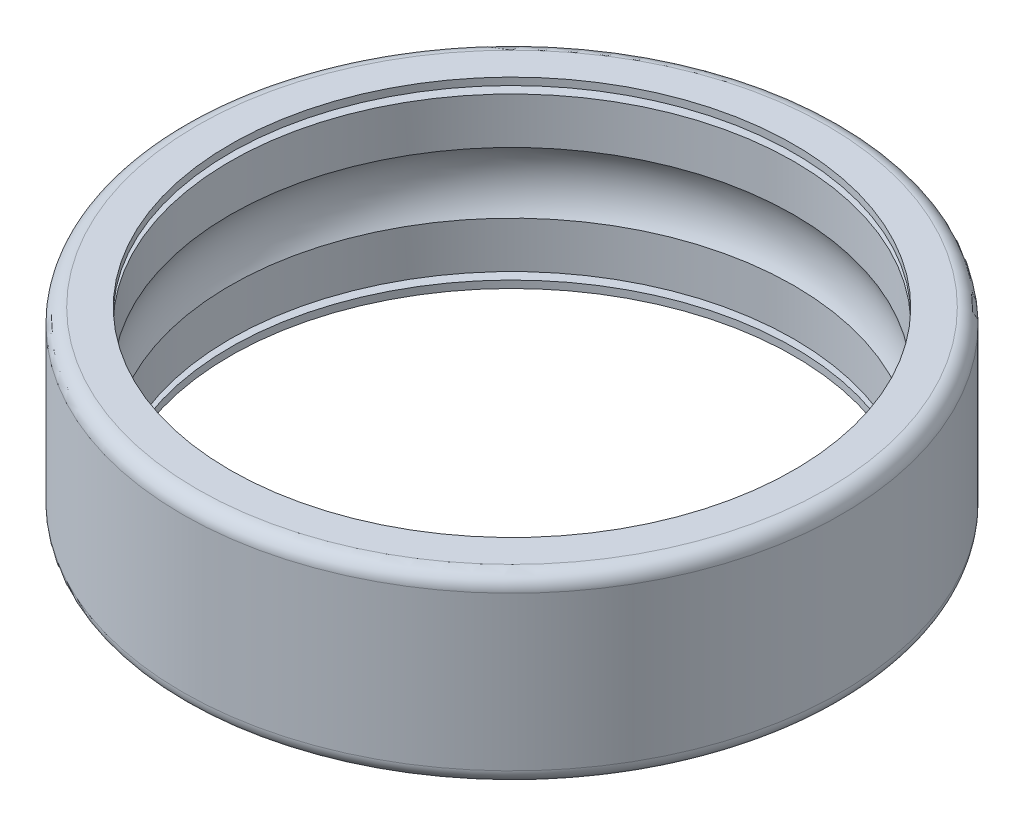
ISO-10303-21;
HEADER;
FILE_DESCRIPTION(('STEP AP214'),'2;1');
FILE_NAME('part.step','',(''),(''),'','','');
FILE_SCHEMA(('AUTOMOTIVE_DESIGN { 1 0 10303 214 1 1 1 1 }'));
ENDSEC;
DATA;
#1=APPLICATION_CONTEXT('core data for automotive mechanical design processes');
#2=APPLICATION_PROTOCOL_DEFINITION('international standard','automotive_design',2000,#1);
#3=PRODUCT_CONTEXT('',#1,'mechanical');
#4=PRODUCT('Part','Part','',(#3));
#5=PRODUCT_RELATED_PRODUCT_CATEGORY('part','',(#4));
#6=PRODUCT_DEFINITION_FORMATION('','',#4);
#7=PRODUCT_DEFINITION_CONTEXT('part definition',#1,'design');
#8=PRODUCT_DEFINITION('design','',#6,#7);
#9=PRODUCT_DEFINITION_SHAPE('','',#8);
#10=(LENGTH_UNIT() NAMED_UNIT(*) SI_UNIT(.MILLI.,.METRE.));
#11=(NAMED_UNIT(*) PLANE_ANGLE_UNIT() SI_UNIT($,.RADIAN.));
#12=(NAMED_UNIT(*) SI_UNIT($,.STERADIAN.) SOLID_ANGLE_UNIT());
#13=UNCERTAINTY_MEASURE_WITH_UNIT(LENGTH_MEASURE(1.E-05),#10,'distance_accuracy_value','');
#14=(GEOMETRIC_REPRESENTATION_CONTEXT(3) GLOBAL_UNCERTAINTY_ASSIGNED_CONTEXT((#13)) GLOBAL_UNIT_ASSIGNED_CONTEXT((#10,
#11,#12)) REPRESENTATION_CONTEXT('',''));
#15=CARTESIAN_POINT('',(0.,0.,0.));
#16=DIRECTION('',(0.,0.,1.));
#17=DIRECTION('',(1.,0.,0.));
#18=AXIS2_PLACEMENT_3D('',#15,#16,#17);
#19=CARTESIAN_POINT('',(0.,-1.375,0.));
#20=DIRECTION('',(0.,1.,0.));
#21=DIRECTION('',(0.,0.,-1.));
#22=AXIS2_PLACEMENT_3D('',#19,#20,#21);
#23=CYLINDRICAL_SURFACE('',#22,3.85);
#24=CARTESIAN_POINT('',(0.,-1.05,0.));
#25=DIRECTION('',(0.,1.,0.));
#26=DIRECTION('',(0.,0.,-1.));
#27=AXIS2_PLACEMENT_3D('',#24,#25,#26);
#28=CIRCLE('',#27,3.85);
#29=CARTESIAN_POINT('',(0.,-1.05,3.85));
#30=VERTEX_POINT('',#29);
#31=EDGE_CURVE('E11',#30,#30,#28,.T.);
#32=ORIENTED_EDGE('',*,*,#31,.F.);
#33=EDGE_LOOP('',(#32));
#34=FACE_BOUND('',#33,.T.);
#35=CARTESIAN_POINT('',(0.,-0.4181040540344,0.));
#36=DIRECTION('',(0.,1.,0.));
#37=DIRECTION('',(0.,0.,-1.));
#38=AXIS2_PLACEMENT_3D('',#35,#36,#37);
#39=CIRCLE('',#38,3.85);
#40=CARTESIAN_POINT('',(0.,-0.4181040540344,-3.85));
#41=VERTEX_POINT('',#40);
#42=EDGE_CURVE('E113',#41,#41,#39,.T.);
#43=ORIENTED_EDGE('',*,*,#42,.T.);
#44=EDGE_LOOP('',(#43));
#45=FACE_BOUND('',#44,.T.);
#46=ADVANCED_FACE('F16',(#34,#45),#23,.F.);
#47=CARTESIAN_POINT('',(0.,-1.05,0.));
#48=DIRECTION('',(0.,1.,0.));
#49=DIRECTION('',(1.,0.,0.));
#50=AXIS2_PLACEMENT_3D('',#47,#48,#49);
#51=PLANE('',#50);
#52=ORIENTED_EDGE('',*,*,#31,.T.);
#53=EDGE_LOOP('',(#52));
#54=FACE_BOUND('',#53,.T.);
#55=CARTESIAN_POINT('',(0.,-1.05,0.));
#56=DIRECTION('',(0.,-1.,0.));
#57=DIRECTION('',(0.,0.,-1.));
#58=AXIS2_PLACEMENT_3D('',#55,#56,#57);
#59=CIRCLE('',#58,4.25);
#60=CARTESIAN_POINT('',(0.,-1.05,4.25));
#61=VERTEX_POINT('',#60);
#62=EDGE_CURVE('E27',#61,#61,#59,.T.);
#63=ORIENTED_EDGE('',*,*,#62,.T.);
#64=EDGE_LOOP('',(#63));
#65=FACE_BOUND('',#64,.T.);
#66=ADVANCED_FACE('F18',(#54,#65),#51,.F.);
#67=CARTESIAN_POINT('',(0.,-1.375,0.));
#68=DIRECTION('',(0.,1.,0.));
#69=DIRECTION('',(0.,0.,-1.));
#70=AXIS2_PLACEMENT_3D('',#67,#68,#69);
#71=CYLINDRICAL_SURFACE('',#70,4.25);
#72=CARTESIAN_POINT('',(0.,-1.15,0.));
#73=DIRECTION('',(0.,1.,0.));
#74=DIRECTION('',(0.,0.,-1.));
#75=AXIS2_PLACEMENT_3D('',#72,#73,#74);
#76=CIRCLE('',#75,4.25);
#77=CARTESIAN_POINT('',(0.,-1.15,4.25));
#78=VERTEX_POINT('',#77);
#79=EDGE_CURVE('E118',#78,#78,#76,.T.);
#80=ORIENTED_EDGE('',*,*,#79,.F.);
#81=EDGE_LOOP('',(#80));
#82=FACE_BOUND('',#81,.T.);
#83=ORIENTED_EDGE('',*,*,#62,.F.);
#84=EDGE_LOOP('',(#83));
#85=FACE_BOUND('',#84,.T.);
#86=ADVANCED_FACE('F150',(#82,#85),#71,.F.);
#87=CARTESIAN_POINT('',(0.,-1.15,0.));
#88=DIRECTION('',(0.,1.,0.));
#89=DIRECTION('',(1.,0.,0.));
#90=AXIS2_PLACEMENT_3D('',#87,#88,#89);
#91=PLANE('',#90);
#92=CARTESIAN_POINT('',(0.,-1.15,0.));
#93=DIRECTION('',(0.,-1.,0.));
#94=DIRECTION('',(0.,0.,-1.));
#95=AXIS2_PLACEMENT_3D('',#92,#93,#94);
#96=CIRCLE('',#95,3.85);
#97=CARTESIAN_POINT('',(0.,-1.15,3.85));
#98=VERTEX_POINT('',#97);
#99=EDGE_CURVE('E115',#98,#98,#96,.T.);
#100=ORIENTED_EDGE('',*,*,#99,.T.);
#101=EDGE_LOOP('',(#100));
#102=FACE_BOUND('',#101,.T.);
#103=ORIENTED_EDGE('',*,*,#79,.T.);
#104=EDGE_LOOP('',(#103));
#105=FACE_BOUND('',#104,.T.);
#106=ADVANCED_FACE('F145',(#102,#105),#91,.T.);
#107=CARTESIAN_POINT('',(0.,-1.375,0.));
#108=DIRECTION('',(0.,1.,0.));
#109=DIRECTION('',(0.,0.,-1.));
#110=AXIS2_PLACEMENT_3D('',#107,#108,#109);
#111=CYLINDRICAL_SURFACE('',#110,3.85);
#112=CARTESIAN_POINT('',(0.,-1.25,0.));
#113=DIRECTION('',(0.,1.,0.));
#114=DIRECTION('',(0.,0.,-1.));
#115=AXIS2_PLACEMENT_3D('',#112,#113,#114);
#116=CIRCLE('',#115,3.85);
#117=CARTESIAN_POINT('',(0.,-1.25,3.85));
#118=VERTEX_POINT('',#117);
#119=EDGE_CURVE('E119',#118,#118,#116,.T.);
#120=ORIENTED_EDGE('',*,*,#119,.F.);
#121=EDGE_LOOP('',(#120));
#122=FACE_BOUND('',#121,.T.);
#123=ORIENTED_EDGE('',*,*,#99,.F.);
#124=EDGE_LOOP('',(#123));
#125=FACE_BOUND('',#124,.T.);
#126=ADVANCED_FACE('F142',(#122,#125),#111,.F.);
#127=CARTESIAN_POINT('',(0.,-1.25,0.));
#128=DIRECTION('',(0.,1.,0.));
#129=DIRECTION('',(1.,0.,0.));
#130=AXIS2_PLACEMENT_3D('',#127,#128,#129);
#131=PLANE('',#130);
#132=ORIENTED_EDGE('',*,*,#119,.T.);
#133=EDGE_LOOP('',(#132));
#134=FACE_BOUND('',#133,.T.);
#135=CARTESIAN_POINT('',(0.,-1.25,0.));
#136=DIRECTION('',(0.,-1.,0.));
#137=DIRECTION('',(0.,0.,-1.));
#138=AXIS2_PLACEMENT_3D('',#135,#136,#137);
#139=CIRCLE('',#138,4.3);
#140=CARTESIAN_POINT('',(0.,-1.25,4.3));
#141=VERTEX_POINT('',#140);
#142=EDGE_CURVE('E104',#141,#141,#139,.T.);
#143=ORIENTED_EDGE('',*,*,#142,.T.);
#144=EDGE_LOOP('',(#143));
#145=FACE_BOUND('',#144,.T.);
#146=ADVANCED_FACE('F139',(#134,#145),#131,.F.);
#147=CARTESIAN_POINT('',(0.,-1.05,0.));
#148=DIRECTION('',(0.,1.,0.));
#149=DIRECTION('',(0.,0.,-1.));
#150=AXIS2_PLACEMENT_3D('',#147,#148,#149);
#151=TOROIDAL_SURFACE('',#150,4.3,0.2);
#152=CARTESIAN_POINT('',(0.,-1.05,0.));
#153=DIRECTION('',(0.,-1.,0.));
#154=DIRECTION('',(0.,0.,-1.));
#155=AXIS2_PLACEMENT_3D('',#152,#153,#154);
#156=CIRCLE('',#155,4.5);
#157=CARTESIAN_POINT('',(0.,-1.05,-4.5));
#158=VERTEX_POINT('',#157);
#159=EDGE_CURVE('E97',#158,#158,#156,.T.);
#160=ORIENTED_EDGE('',*,*,#159,.T.);
#161=EDGE_LOOP('',(#160));
#162=FACE_BOUND('',#161,.T.);
#163=ORIENTED_EDGE('',*,*,#142,.F.);
#164=EDGE_LOOP('',(#163));
#165=FACE_BOUND('',#164,.T.);
#166=ADVANCED_FACE('F173',(#162,#165),#151,.T.);
#167=CARTESIAN_POINT('',(0.,-1.375,0.));
#168=DIRECTION('',(0.,1.,0.));
#169=DIRECTION('',(0.,0.,-1.));
#170=AXIS2_PLACEMENT_3D('',#167,#168,#169);
#171=CYLINDRICAL_SURFACE('',#170,4.5);
#172=ORIENTED_EDGE('',*,*,#159,.F.);
#173=EDGE_LOOP('',(#172));
#174=FACE_BOUND('',#173,.T.);
#175=CARTESIAN_POINT('',(0.,1.05,0.));
#176=DIRECTION('',(0.,-1.,0.));
#177=DIRECTION('',(0.,0.,-1.));
#178=AXIS2_PLACEMENT_3D('',#175,#176,#177);
#179=CIRCLE('',#178,4.5);
#180=CARTESIAN_POINT('',(0.,1.05,4.5));
#181=VERTEX_POINT('',#180);
#182=EDGE_CURVE('E93',#181,#181,#179,.T.);
#183=ORIENTED_EDGE('',*,*,#182,.T.);
#184=EDGE_LOOP('',(#183));
#185=FACE_BOUND('',#184,.T.);
#186=ADVANCED_FACE('F94',(#174,#185),#171,.T.);
#187=CARTESIAN_POINT('',(0.,1.05,0.));
#188=DIRECTION('',(0.,1.,0.));
#189=DIRECTION('',(0.,0.,-1.));
#190=AXIS2_PLACEMENT_3D('',#187,#188,#189);
#191=TOROIDAL_SURFACE('',#190,4.3,0.2);
#192=CARTESIAN_POINT('',(0.,1.25,0.));
#193=DIRECTION('',(0.,1.,0.));
#194=DIRECTION('',(0.,0.,-1.));
#195=AXIS2_PLACEMENT_3D('',#192,#193,#194);
#196=CIRCLE('',#195,4.3);
#197=CARTESIAN_POINT('',(0.,1.25,4.3));
#198=VERTEX_POINT('',#197);
#199=EDGE_CURVE('E98',#198,#198,#196,.T.);
#200=ORIENTED_EDGE('',*,*,#199,.F.);
#201=EDGE_LOOP('',(#200));
#202=FACE_BOUND('',#201,.T.);
#203=ORIENTED_EDGE('',*,*,#182,.F.);
#204=EDGE_LOOP('',(#203));
#205=FACE_BOUND('',#204,.T.);
#206=ADVANCED_FACE('F207',(#202,#205),#191,.T.);
#207=CARTESIAN_POINT('',(0.,1.25,0.));
#208=DIRECTION('',(0.,1.,0.));
#209=DIRECTION('',(1.,0.,0.));
#210=AXIS2_PLACEMENT_3D('',#207,#208,#209);
#211=PLANE('',#210);
#212=CARTESIAN_POINT('',(0.,1.25,0.));
#213=DIRECTION('',(0.,-1.,0.));
#214=DIRECTION('',(0.,0.,-1.));
#215=AXIS2_PLACEMENT_3D('',#212,#213,#214);
#216=CIRCLE('',#215,3.85);
#217=CARTESIAN_POINT('',(0.,1.25,3.85));
#218=VERTEX_POINT('',#217);
#219=EDGE_CURVE('E107',#218,#218,#216,.T.);
#220=ORIENTED_EDGE('',*,*,#219,.T.);
#221=EDGE_LOOP('',(#220));
#222=FACE_BOUND('',#221,.T.);
#223=ORIENTED_EDGE('',*,*,#199,.T.);
#224=EDGE_LOOP('',(#223));
#225=FACE_BOUND('',#224,.T.);
#226=ADVANCED_FACE('F202',(#222,#225),#211,.T.);
#227=CARTESIAN_POINT('',(0.,-1.375,0.));
#228=DIRECTION('',(0.,1.,0.));
#229=DIRECTION('',(0.,0.,-1.));
#230=AXIS2_PLACEMENT_3D('',#227,#228,#229);
#231=CYLINDRICAL_SURFACE('',#230,3.85);
#232=CARTESIAN_POINT('',(0.,1.15,0.));
#233=DIRECTION('',(0.,1.,0.));
#234=DIRECTION('',(0.,0.,-1.));
#235=AXIS2_PLACEMENT_3D('',#232,#233,#234);
#236=CIRCLE('',#235,3.85);
#237=CARTESIAN_POINT('',(0.,1.15,3.85));
#238=VERTEX_POINT('',#237);
#239=EDGE_CURVE('E110',#238,#238,#236,.T.);
#240=ORIENTED_EDGE('',*,*,#239,.F.);
#241=EDGE_LOOP('',(#240));
#242=FACE_BOUND('',#241,.T.);
#243=ORIENTED_EDGE('',*,*,#219,.F.);
#244=EDGE_LOOP('',(#243));
#245=FACE_BOUND('',#244,.T.);
#246=ADVANCED_FACE('F196',(#242,#245),#231,.F.);
#247=CARTESIAN_POINT('',(0.,1.15,0.));
#248=DIRECTION('',(0.,1.,0.));
#249=DIRECTION('',(1.,0.,0.));
#250=AXIS2_PLACEMENT_3D('',#247,#248,#249);
#251=PLANE('',#250);
#252=ORIENTED_EDGE('',*,*,#239,.T.);
#253=EDGE_LOOP('',(#252));
#254=FACE_BOUND('',#253,.T.);
#255=CARTESIAN_POINT('',(0.,1.15,0.));
#256=DIRECTION('',(0.,-1.,0.));
#257=DIRECTION('',(0.,0.,-1.));
#258=AXIS2_PLACEMENT_3D('',#255,#256,#257);
#259=CIRCLE('',#258,4.25);
#260=CARTESIAN_POINT('',(0.,1.15,4.25));
#261=VERTEX_POINT('',#260);
#262=EDGE_CURVE('E122',#261,#261,#259,.T.);
#263=ORIENTED_EDGE('',*,*,#262,.T.);
#264=EDGE_LOOP('',(#263));
#265=FACE_BOUND('',#264,.T.);
#266=ADVANCED_FACE('F186',(#254,#265),#251,.F.);
#267=CARTESIAN_POINT('',(0.,-1.375,0.));
#268=DIRECTION('',(0.,1.,0.));
#269=DIRECTION('',(0.,0.,-1.));
#270=AXIS2_PLACEMENT_3D('',#267,#268,#269);
#271=CYLINDRICAL_SURFACE('',#270,4.25);
#272=CARTESIAN_POINT('',(0.,1.05,0.));
#273=DIRECTION('',(0.,1.,0.));
#274=DIRECTION('',(0.,0.,-1.));
#275=AXIS2_PLACEMENT_3D('',#272,#273,#274);
#276=CIRCLE('',#275,4.25);
#277=CARTESIAN_POINT('',(0.,1.05,4.25));
#278=VERTEX_POINT('',#277);
#279=EDGE_CURVE('E112',#278,#278,#276,.T.);
#280=ORIENTED_EDGE('',*,*,#279,.F.);
#281=EDGE_LOOP('',(#280));
#282=FACE_BOUND('',#281,.T.);
#283=ORIENTED_EDGE('',*,*,#262,.F.);
#284=EDGE_LOOP('',(#283));
#285=FACE_BOUND('',#284,.T.);
#286=ADVANCED_FACE('F177',(#282,#285),#271,.F.);
#287=CARTESIAN_POINT('',(0.,1.05,0.));
#288=DIRECTION('',(0.,1.,0.));
#289=DIRECTION('',(1.,0.,0.));
#290=AXIS2_PLACEMENT_3D('',#287,#288,#289);
#291=PLANE('',#290);
#292=CARTESIAN_POINT('',(0.,1.05,0.));
#293=DIRECTION('',(0.,-1.,0.));
#294=DIRECTION('',(0.,0.,-1.));
#295=AXIS2_PLACEMENT_3D('',#292,#293,#294);
#296=CIRCLE('',#295,3.85);
#297=CARTESIAN_POINT('',(0.,1.05,-3.85));
#298=VERTEX_POINT('',#297);
#299=EDGE_CURVE('E111',#298,#298,#296,.T.);
#300=ORIENTED_EDGE('',*,*,#299,.T.);
#301=EDGE_LOOP('',(#300));
#302=FACE_BOUND('',#301,.T.);
#303=ORIENTED_EDGE('',*,*,#279,.T.);
#304=EDGE_LOOP('',(#303));
#305=FACE_BOUND('',#304,.T.);
#306=ADVANCED_FACE('F174',(#302,#305),#291,.T.);
#307=CARTESIAN_POINT('',(0.,-1.375,0.));
#308=DIRECTION('',(0.,1.,0.));
#309=DIRECTION('',(0.,0.,-1.));
#310=AXIS2_PLACEMENT_3D('',#307,#308,#309);
#311=CYLINDRICAL_SURFACE('',#310,3.85);
#312=ORIENTED_EDGE('',*,*,#299,.F.);
#313=EDGE_LOOP('',(#312));
#314=FACE_BOUND('',#313,.T.);
#315=CARTESIAN_POINT('',(0.,0.4181040540344,0.));
#316=DIRECTION('',(0.,-1.,0.));
#317=DIRECTION('',(0.,0.,-1.));
#318=AXIS2_PLACEMENT_3D('',#315,#316,#317);
#319=CIRCLE('',#318,3.85);
#320=CARTESIAN_POINT('',(0.,0.4181040540344,3.85));
#321=VERTEX_POINT('',#320);
#322=EDGE_CURVE('E20',#321,#321,#319,.T.);
#323=ORIENTED_EDGE('',*,*,#322,.T.);
#324=EDGE_LOOP('',(#323));
#325=FACE_BOUND('',#324,.T.);
#326=ADVANCED_FACE('F176',(#314,#325),#311,.F.);
#327=CARTESIAN_POINT('',(0.,0.,0.));
#328=DIRECTION('',(0.,1.,0.));
#329=DIRECTION('',(0.,0.,-1.));
#330=AXIS2_PLACEMENT_3D('',#327,#328,#329);
#331=TOROIDAL_SURFACE('',#330,3.175,0.794);
#332=ORIENTED_EDGE('',*,*,#42,.F.);
#333=EDGE_LOOP('',(#332));
#334=FACE_BOUND('',#333,.T.);
#335=ORIENTED_EDGE('',*,*,#322,.F.);
#336=EDGE_LOOP('',(#335));
#337=FACE_BOUND('',#336,.T.);
#338=ADVANCED_FACE('F183',(#334,#337),#331,.F.);
#339=CLOSED_SHELL('',(#46,#66,#86,#106,#126,#146,#166,#186,#206,#226,#246,#266,#286,#306,#326,#338));
#340=MANIFOLD_SOLID_BREP('B1',#339);
#341=ADVANCED_BREP_SHAPE_REPRESENTATION('',(#18,#340),#14);
#342=SHAPE_DEFINITION_REPRESENTATION(#9,#341);
ENDSEC;
END-ISO-10303-21;
